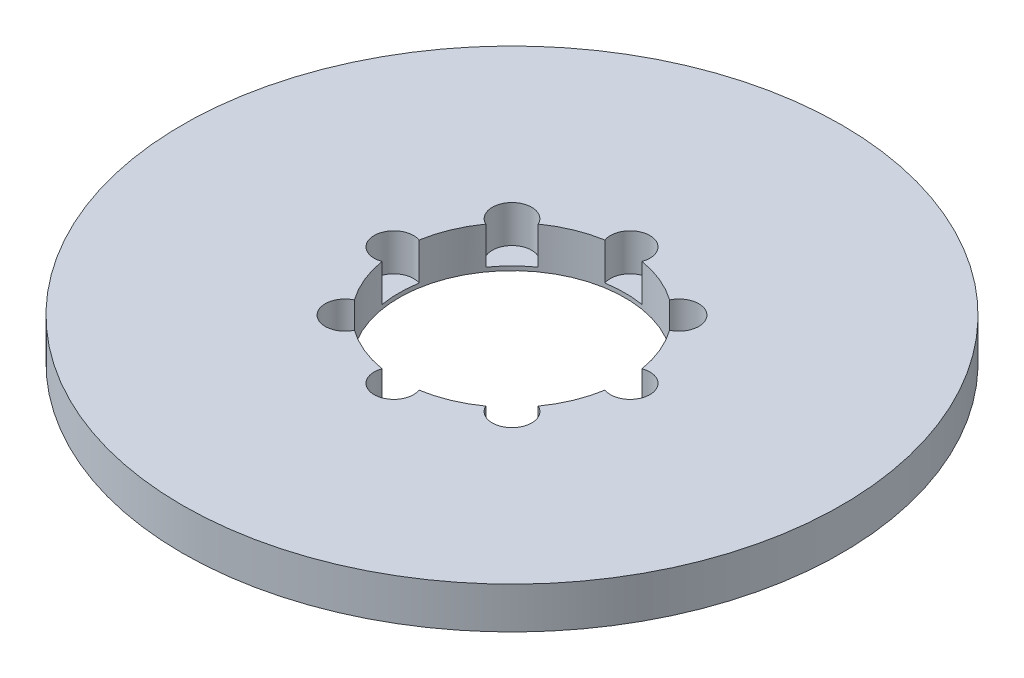
ISO-10303-21;
HEADER;
FILE_DESCRIPTION(('STEP AP214'),'2;1');
FILE_NAME('part.step','',(''),(''),'','','');
FILE_SCHEMA(('AUTOMOTIVE_DESIGN { 1 0 10303 214 1 1 1 1 }'));
ENDSEC;
DATA;
#1=APPLICATION_CONTEXT('core data for automotive mechanical design processes');
#2=APPLICATION_PROTOCOL_DEFINITION('international standard','automotive_design',2000,#1);
#3=PRODUCT_CONTEXT('',#1,'mechanical');
#4=PRODUCT('Part','Part','',(#3));
#5=PRODUCT_RELATED_PRODUCT_CATEGORY('part','',(#4));
#6=PRODUCT_DEFINITION_FORMATION('','',#4);
#7=PRODUCT_DEFINITION_CONTEXT('part definition',#1,'design');
#8=PRODUCT_DEFINITION('design','',#6,#7);
#9=PRODUCT_DEFINITION_SHAPE('','',#8);
#10=(LENGTH_UNIT() NAMED_UNIT(*) SI_UNIT(.MILLI.,.METRE.));
#11=(NAMED_UNIT(*) PLANE_ANGLE_UNIT() SI_UNIT($,.RADIAN.));
#12=(NAMED_UNIT(*) SI_UNIT($,.STERADIAN.) SOLID_ANGLE_UNIT());
#13=UNCERTAINTY_MEASURE_WITH_UNIT(LENGTH_MEASURE(1.E-05),#10,'distance_accuracy_value','');
#14=(GEOMETRIC_REPRESENTATION_CONTEXT(3) GLOBAL_UNCERTAINTY_ASSIGNED_CONTEXT((#13)) GLOBAL_UNIT_ASSIGNED_CONTEXT((#10,
#11,#12)) REPRESENTATION_CONTEXT('',''));
#15=CARTESIAN_POINT('',(0.,0.,0.));
#16=DIRECTION('',(0.,0.,1.));
#17=DIRECTION('',(1.,0.,0.));
#18=AXIS2_PLACEMENT_3D('',#15,#16,#17);
#19=CARTESIAN_POINT('',(0.,11.,0.));
#20=DIRECTION('',(0.,-1.,0.));
#21=DIRECTION('',(0.,0.,-1.));
#22=AXIS2_PLACEMENT_3D('',#19,#20,#21);
#23=CYLINDRICAL_SURFACE('',#22,87.5);
#24=CARTESIAN_POINT('',(0.,11.,0.));
#25=DIRECTION('',(0.,1.,0.));
#26=DIRECTION('',(0.,0.,1.));
#27=AXIS2_PLACEMENT_3D('',#24,#25,#26);
#28=CIRCLE('',#27,87.5);
#29=CARTESIAN_POINT('',(0.,11.,87.5));
#30=VERTEX_POINT('',#29);
#31=EDGE_CURVE('E195',#30,#30,#28,.T.);
#32=ORIENTED_EDGE('',*,*,#31,.F.);
#33=EDGE_LOOP('',(#32));
#34=FACE_BOUND('',#33,.T.);
#35=CARTESIAN_POINT('',(0.,0.,0.));
#36=DIRECTION('',(0.,1.,0.));
#37=DIRECTION('',(0.,0.,1.));
#38=AXIS2_PLACEMENT_3D('',#35,#36,#37);
#39=CIRCLE('',#38,87.5);
#40=CARTESIAN_POINT('',(0.,0.,87.5));
#41=VERTEX_POINT('',#40);
#42=EDGE_CURVE('E179',#41,#41,#39,.T.);
#43=ORIENTED_EDGE('',*,*,#42,.T.);
#44=EDGE_LOOP('',(#43));
#45=FACE_BOUND('',#44,.T.);
#46=ADVANCED_FACE('F39',(#34,#45),#23,.T.);
#47=CARTESIAN_POINT('',(0.,11.,0.));
#48=DIRECTION('',(0.,1.,0.));
#49=DIRECTION('',(0.,0.,1.));
#50=AXIS2_PLACEMENT_3D('',#47,#48,#49);
#51=PLANE('',#50);
#52=CARTESIAN_POINT('',(1.09510492240665E-13,11.,31.3650515677538));
#53=DIRECTION('',(0.,1.,0.));
#54=DIRECTION('',(1.,0.,0.));
#55=AXIS2_PLACEMENT_3D('',#52,#53,#54);
#56=CIRCLE('',#55,5.23700940678586);
#57=CARTESIAN_POINT('',(-4.92791098993009,11.,29.5924938671165));
#58=VERTEX_POINT('',#57);
#59=CARTESIAN_POINT('',(4.9279109899303,11.,29.5924938671164));
#60=VERTEX_POINT('',#59);
#61=EDGE_CURVE('E176',#58,#60,#56,.T.);
#62=ORIENTED_EDGE('',*,*,#61,.F.);
#63=CARTESIAN_POINT('',(0.,11.,0.));
#64=DIRECTION('',(0.,1.,0.));
#65=DIRECTION('',(0.,0.,1.));
#66=AXIS2_PLACEMENT_3D('',#63,#64,#65);
#67=CIRCLE('',#66,30.);
#68=CARTESIAN_POINT('',(-17.440493807596,11.,24.4096123637228));
#69=VERTEX_POINT('',#68);
#70=EDGE_CURVE('E166',#69,#58,#67,.T.);
#71=ORIENTED_EDGE('',*,*,#70,.F.);
#72=CARTESIAN_POINT('',(-22.1784406558244,11.,22.1784406558245));
#73=DIRECTION('',(0.,1.,0.));
#74=DIRECTION('',(0.707106781186549,0.,0.707106781186546));
#75=AXIS2_PLACEMENT_3D('',#72,#73,#74);
#76=CIRCLE('',#75,5.23700940678586);
#77=CARTESIAN_POINT('',(-24.4096123637227,11.,17.4404938075961));
#78=VERTEX_POINT('',#77);
#79=EDGE_CURVE('E147',#78,#69,#76,.T.);
#80=ORIENTED_EDGE('',*,*,#79,.F.);
#81=CARTESIAN_POINT('',(-29.5924938671165,11.,4.9279109899302));
#82=VERTEX_POINT('',#81);
#83=EDGE_CURVE('E180',#82,#78,#67,.T.);
#84=ORIENTED_EDGE('',*,*,#83,.F.);
#85=CARTESIAN_POINT('',(-31.3650515677538,11.,0.));
#86=DIRECTION('',(0.,1.,0.));
#87=DIRECTION('',(0.,0.,1.));
#88=AXIS2_PLACEMENT_3D('',#85,#86,#87);
#89=CIRCLE('',#88,5.23700940678586);
#90=CARTESIAN_POINT('',(-29.5924938671165,11.,-4.9279109899302));
#91=VERTEX_POINT('',#90);
#92=EDGE_CURVE('E186',#91,#82,#89,.T.);
#93=ORIENTED_EDGE('',*,*,#92,.F.);
#94=CARTESIAN_POINT('',(-24.4096123637229,11.,-17.4404938075957));
#95=VERTEX_POINT('',#94);
#96=EDGE_CURVE('E182',#95,#91,#67,.T.);
#97=ORIENTED_EDGE('',*,*,#96,.F.);
#98=CARTESIAN_POINT('',(-22.1784406558248,11.,-22.1784406558242));
#99=DIRECTION('',(0.,1.,0.));
#100=DIRECTION('',(-0.707106781186539,0.,0.707106781186556));
#101=AXIS2_PLACEMENT_3D('',#98,#99,#100);
#102=CIRCLE('',#101,5.23700940678586);
#103=CARTESIAN_POINT('',(-17.4404938075963,11.,-24.4096123637225));
#104=VERTEX_POINT('',#103);
#105=EDGE_CURVE('E446',#104,#95,#102,.T.);
#106=ORIENTED_EDGE('',*,*,#105,.F.);
#107=CARTESIAN_POINT('',(-4.92791098993051,11.,-29.5924938671164));
#108=VERTEX_POINT('',#107);
#109=EDGE_CURVE('E452',#108,#104,#67,.T.);
#110=ORIENTED_EDGE('',*,*,#109,.F.);
#111=CARTESIAN_POINT('',(-3.28531476721995E-13,11.,-31.3650515677538));
#112=DIRECTION('',(0.,1.,0.));
#113=DIRECTION('',(-1.,0.,0.));
#114=AXIS2_PLACEMENT_3D('',#111,#112,#113);
#115=CIRCLE('',#114,5.23700940678586);
#116=CARTESIAN_POINT('',(4.92791098992989,11.,-29.5924938671165));
#117=VERTEX_POINT('',#116);
#118=EDGE_CURVE('E477',#117,#108,#115,.T.);
#119=ORIENTED_EDGE('',*,*,#118,.F.);
#120=CARTESIAN_POINT('',(17.4404938075958,11.,-24.4096123637229));
#121=VERTEX_POINT('',#120);
#122=EDGE_CURVE('E460',#121,#117,#67,.T.);
#123=ORIENTED_EDGE('',*,*,#122,.F.);
#124=CARTESIAN_POINT('',(22.1784406558243,11.,-22.1784406558247));
#125=DIRECTION('',(0.,1.,0.));
#126=DIRECTION('',(-0.707106781186554,0.,-0.707106781186541));
#127=AXIS2_PLACEMENT_3D('',#124,#125,#126);
#128=CIRCLE('',#127,5.23700940678586);
#129=CARTESIAN_POINT('',(24.4096123637226,11.,-17.4404938075962));
#130=VERTEX_POINT('',#129);
#131=EDGE_CURVE('E464',#130,#121,#128,.T.);
#132=ORIENTED_EDGE('',*,*,#131,.F.);
#133=CARTESIAN_POINT('',(29.5924938671165,11.,-4.9279109899302));
#134=VERTEX_POINT('',#133);
#135=EDGE_CURVE('E459',#134,#130,#67,.T.);
#136=ORIENTED_EDGE('',*,*,#135,.F.);
#137=CARTESIAN_POINT('',(31.3650515677538,11.,0.));
#138=DIRECTION('',(0.,1.,0.));
#139=DIRECTION('',(0.,0.,-1.));
#140=AXIS2_PLACEMENT_3D('',#137,#138,#139);
#141=CIRCLE('',#140,5.23700940678586);
#142=CARTESIAN_POINT('',(29.5924938671165,11.,4.9279109899302));
#143=VERTEX_POINT('',#142);
#144=EDGE_CURVE('E469',#143,#134,#141,.T.);
#145=ORIENTED_EDGE('',*,*,#144,.F.);
#146=CARTESIAN_POINT('',(24.4096123637228,11.,17.4404938075959));
#147=VERTEX_POINT('',#146);
#148=EDGE_CURVE('E181',#147,#143,#67,.T.);
#149=ORIENTED_EDGE('',*,*,#148,.F.);
#150=CARTESIAN_POINT('',(22.1784406558246,11.,22.1784406558244));
#151=DIRECTION('',(0.,1.,0.));
#152=DIRECTION('',(0.707106781186544,0.,-0.707106781186551));
#153=AXIS2_PLACEMENT_3D('',#150,#151,#152);
#154=CIRCLE('',#153,5.23700940678586);
#155=CARTESIAN_POINT('',(17.4404938075961,11.,24.4096123637226));
#156=VERTEX_POINT('',#155);
#157=EDGE_CURVE('E475',#156,#147,#154,.T.);
#158=ORIENTED_EDGE('',*,*,#157,.F.);
#159=EDGE_CURVE('E177',#60,#156,#67,.T.);
#160=ORIENTED_EDGE('',*,*,#159,.F.);
#161=EDGE_LOOP('',(#62,#71,#80,#84,#93,#97,#106,#110,#119,#123,#132,#136,#145,#149,#158,#160));
#162=FACE_BOUND('',#161,.T.);
#163=ORIENTED_EDGE('',*,*,#31,.T.);
#164=EDGE_LOOP('',(#163));
#165=FACE_BOUND('',#164,.T.);
#166=ADVANCED_FACE('F172',(#162,#165),#51,.T.);
#167=CARTESIAN_POINT('',(0.,0.,0.));
#168=DIRECTION('',(0.,1.,0.));
#169=DIRECTION('',(0.,0.,1.));
#170=AXIS2_PLACEMENT_3D('',#167,#168,#169);
#171=PLANE('',#170);
#172=CARTESIAN_POINT('',(0.,0.,0.));
#173=DIRECTION('',(0.,1.,0.));
#174=DIRECTION('',(0.,0.,1.));
#175=AXIS2_PLACEMENT_3D('',#172,#173,#174);
#176=CIRCLE('',#175,30.);
#177=CARTESIAN_POINT('',(0.,0.,30.));
#178=VERTEX_POINT('',#177);
#179=EDGE_CURVE('E187',#178,#178,#176,.T.);
#180=ORIENTED_EDGE('',*,*,#179,.T.);
#181=EDGE_LOOP('',(#180));
#182=FACE_BOUND('',#181,.T.);
#183=ORIENTED_EDGE('',*,*,#42,.F.);
#184=EDGE_LOOP('',(#183));
#185=FACE_BOUND('',#184,.T.);
#186=ADVANCED_FACE('F270',(#182,#185),#171,.F.);
#187=CARTESIAN_POINT('',(0.,11.,0.));
#188=DIRECTION('',(0.,-1.,0.));
#189=DIRECTION('',(0.,0.,-1.));
#190=AXIS2_PLACEMENT_3D('',#187,#188,#189);
#191=CYLINDRICAL_SURFACE('',#190,30.);
#192=DIRECTION('',(0.,1.,0.));
#193=VECTOR('',#192,1.);
#194=CARTESIAN_POINT('',(-4.92791098993009,6.05336357226162,29.5924938671165));
#195=LINE('',#194,#193);
#196=CARTESIAN_POINT('',(-4.92791098993009,1.10672714452325,29.5924938671165));
#197=VERTEX_POINT('',#196);
#198=EDGE_CURVE('E11',#197,#58,#195,.T.);
#199=ORIENTED_EDGE('',*,*,#198,.F.);
#200=CARTESIAN_POINT('',(0.,1.10672714452325,0.));
#201=DIRECTION('',(0.,1.,0.));
#202=DIRECTION('',(0.,0.,1.));
#203=AXIS2_PLACEMENT_3D('',#200,#201,#202);
#204=CIRCLE('',#203,30.);
#205=CARTESIAN_POINT('',(4.9279109899303,1.10672714452325,29.5924938671164));
#206=VERTEX_POINT('',#205);
#207=EDGE_CURVE('E250',#197,#206,#204,.T.);
#208=ORIENTED_EDGE('',*,*,#207,.T.);
#209=DIRECTION('',(0.,1.,0.));
#210=VECTOR('',#209,1.);
#211=CARTESIAN_POINT('',(4.9279109899303,6.05336357226162,29.5924938671164));
#212=LINE('',#211,#210);
#213=EDGE_CURVE('E46',#60,#206,#212,.F.);
#214=ORIENTED_EDGE('',*,*,#213,.F.);
#215=ORIENTED_EDGE('',*,*,#159,.T.);
#216=DIRECTION('',(0.,1.,0.));
#217=VECTOR('',#216,1.);
#218=CARTESIAN_POINT('',(17.4404938075961,6.05336357226162,24.4096123637226));
#219=LINE('',#218,#217);
#220=CARTESIAN_POINT('',(17.4404938075961,1.10672714452325,24.4096123637226));
#221=VERTEX_POINT('',#220);
#222=EDGE_CURVE('E244',#221,#156,#219,.T.);
#223=ORIENTED_EDGE('',*,*,#222,.F.);
#224=CARTESIAN_POINT('',(0.,1.10672714452325,0.));
#225=DIRECTION('',(0.,1.,0.));
#226=DIRECTION('',(0.,0.,1.));
#227=AXIS2_PLACEMENT_3D('',#224,#225,#226);
#228=CIRCLE('',#227,30.);
#229=CARTESIAN_POINT('',(24.4096123637228,1.10672714452325,17.4404938075959));
#230=VERTEX_POINT('',#229);
#231=EDGE_CURVE('E238',#221,#230,#228,.T.);
#232=ORIENTED_EDGE('',*,*,#231,.T.);
#233=DIRECTION('',(0.,1.,0.));
#234=VECTOR('',#233,1.);
#235=CARTESIAN_POINT('',(24.4096123637228,6.05336357226162,17.4404938075959));
#236=LINE('',#235,#234);
#237=EDGE_CURVE('E242',#147,#230,#236,.F.);
#238=ORIENTED_EDGE('',*,*,#237,.F.);
#239=ORIENTED_EDGE('',*,*,#148,.T.);
#240=DIRECTION('',(0.,1.,0.));
#241=VECTOR('',#240,1.);
#242=CARTESIAN_POINT('',(29.5924938671165,6.05336357226162,4.9279109899302));
#243=LINE('',#242,#241);
#244=CARTESIAN_POINT('',(29.5924938671165,1.10672714452325,4.9279109899302));
#245=VERTEX_POINT('',#244);
#246=EDGE_CURVE('E236',#245,#143,#243,.T.);
#247=ORIENTED_EDGE('',*,*,#246,.F.);
#248=CARTESIAN_POINT('',(0.,1.10672714452325,0.));
#249=DIRECTION('',(0.,1.,0.));
#250=DIRECTION('',(0.,0.,1.));
#251=AXIS2_PLACEMENT_3D('',#248,#249,#250);
#252=CIRCLE('',#251,30.);
#253=CARTESIAN_POINT('',(29.5924938671165,1.10672714452325,-4.9279109899302));
#254=VERTEX_POINT('',#253);
#255=EDGE_CURVE('E235',#245,#254,#252,.T.);
#256=ORIENTED_EDGE('',*,*,#255,.T.);
#257=DIRECTION('',(0.,1.,0.));
#258=VECTOR('',#257,1.);
#259=CARTESIAN_POINT('',(29.5924938671165,6.05336357226162,-4.9279109899302));
#260=LINE('',#259,#258);
#261=EDGE_CURVE('E234',#134,#254,#260,.F.);
#262=ORIENTED_EDGE('',*,*,#261,.F.);
#263=ORIENTED_EDGE('',*,*,#135,.T.);
#264=DIRECTION('',(0.,1.,0.));
#265=VECTOR('',#264,1.);
#266=CARTESIAN_POINT('',(24.4096123637226,6.05336357226162,-17.4404938075962));
#267=LINE('',#266,#265);
#268=CARTESIAN_POINT('',(24.4096123637226,1.10672714452325,-17.4404938075962));
#269=VERTEX_POINT('',#268);
#270=EDGE_CURVE('E229',#269,#130,#267,.T.);
#271=ORIENTED_EDGE('',*,*,#270,.F.);
#272=CARTESIAN_POINT('',(0.,1.10672714452325,0.));
#273=DIRECTION('',(0.,1.,0.));
#274=DIRECTION('',(0.,0.,1.));
#275=AXIS2_PLACEMENT_3D('',#272,#273,#274);
#276=CIRCLE('',#275,30.);
#277=CARTESIAN_POINT('',(17.4404938075958,1.10672714452325,-24.4096123637229));
#278=VERTEX_POINT('',#277);
#279=EDGE_CURVE('E221',#269,#278,#276,.T.);
#280=ORIENTED_EDGE('',*,*,#279,.T.);
#281=DIRECTION('',(0.,1.,0.));
#282=VECTOR('',#281,1.);
#283=CARTESIAN_POINT('',(17.4404938075958,6.05336357226162,-24.4096123637229));
#284=LINE('',#283,#282);
#285=EDGE_CURVE('E230',#121,#278,#284,.F.);
#286=ORIENTED_EDGE('',*,*,#285,.F.);
#287=ORIENTED_EDGE('',*,*,#122,.T.);
#288=DIRECTION('',(0.,1.,0.));
#289=VECTOR('',#288,1.);
#290=CARTESIAN_POINT('',(4.92791098992989,6.05336357226162,-29.5924938671165));
#291=LINE('',#290,#289);
#292=CARTESIAN_POINT('',(4.92791098992989,1.10672714452325,-29.5924938671165));
#293=VERTEX_POINT('',#292);
#294=EDGE_CURVE('E225',#293,#117,#291,.T.);
#295=ORIENTED_EDGE('',*,*,#294,.F.);
#296=CARTESIAN_POINT('',(0.,1.10672714452325,0.));
#297=DIRECTION('',(0.,1.,0.));
#298=DIRECTION('',(0.,0.,1.));
#299=AXIS2_PLACEMENT_3D('',#296,#297,#298);
#300=CIRCLE('',#299,30.);
#301=CARTESIAN_POINT('',(-4.92791098993051,1.10672714452325,-29.5924938671164));
#302=VERTEX_POINT('',#301);
#303=EDGE_CURVE('E216',#293,#302,#300,.T.);
#304=ORIENTED_EDGE('',*,*,#303,.T.);
#305=DIRECTION('',(0.,1.,0.));
#306=VECTOR('',#305,1.);
#307=CARTESIAN_POINT('',(-4.92791098993051,6.05336357226162,-29.5924938671164));
#308=LINE('',#307,#306);
#309=EDGE_CURVE('E218',#108,#302,#308,.F.);
#310=ORIENTED_EDGE('',*,*,#309,.F.);
#311=ORIENTED_EDGE('',*,*,#109,.T.);
#312=DIRECTION('',(0.,1.,0.));
#313=VECTOR('',#312,1.);
#314=CARTESIAN_POINT('',(-17.4404938075963,6.05336357226162,-24.4096123637225));
#315=LINE('',#314,#313);
#316=CARTESIAN_POINT('',(-17.4404938075963,1.10672714452325,-24.4096123637225));
#317=VERTEX_POINT('',#316);
#318=EDGE_CURVE('E212',#317,#104,#315,.T.);
#319=ORIENTED_EDGE('',*,*,#318,.F.);
#320=CARTESIAN_POINT('',(0.,1.10672714452325,0.));
#321=DIRECTION('',(0.,1.,0.));
#322=DIRECTION('',(0.,0.,1.));
#323=AXIS2_PLACEMENT_3D('',#320,#321,#322);
#324=CIRCLE('',#323,30.);
#325=CARTESIAN_POINT('',(-24.4096123637229,1.10672714452325,-17.4404938075957));
#326=VERTEX_POINT('',#325);
#327=EDGE_CURVE('E208',#317,#326,#324,.T.);
#328=ORIENTED_EDGE('',*,*,#327,.T.);
#329=DIRECTION('',(0.,1.,0.));
#330=VECTOR('',#329,1.);
#331=CARTESIAN_POINT('',(-24.4096123637229,6.05336357226162,-17.4404938075957));
#332=LINE('',#331,#330);
#333=EDGE_CURVE('E211',#95,#326,#332,.F.);
#334=ORIENTED_EDGE('',*,*,#333,.F.);
#335=ORIENTED_EDGE('',*,*,#96,.T.);
#336=DIRECTION('',(0.,1.,0.));
#337=VECTOR('',#336,1.);
#338=CARTESIAN_POINT('',(-29.5924938671165,6.05336357226162,-4.9279109899302));
#339=LINE('',#338,#337);
#340=CARTESIAN_POINT('',(-29.5924938671165,1.10672714452325,-4.9279109899302));
#341=VERTEX_POINT('',#340);
#342=EDGE_CURVE('E201',#341,#91,#339,.T.);
#343=ORIENTED_EDGE('',*,*,#342,.F.);
#344=CARTESIAN_POINT('',(0.,1.10672714452325,0.));
#345=DIRECTION('',(0.,1.,0.));
#346=DIRECTION('',(0.,0.,1.));
#347=AXIS2_PLACEMENT_3D('',#344,#345,#346);
#348=CIRCLE('',#347,30.);
#349=CARTESIAN_POINT('',(-29.5924938671165,1.10672714452325,4.9279109899302));
#350=VERTEX_POINT('',#349);
#351=EDGE_CURVE('E194',#341,#350,#348,.T.);
#352=ORIENTED_EDGE('',*,*,#351,.T.);
#353=DIRECTION('',(0.,1.,0.));
#354=VECTOR('',#353,1.);
#355=CARTESIAN_POINT('',(-29.5924938671165,6.05336357226162,4.9279109899302));
#356=LINE('',#355,#354);
#357=EDGE_CURVE('E199',#82,#350,#356,.F.);
#358=ORIENTED_EDGE('',*,*,#357,.F.);
#359=ORIENTED_EDGE('',*,*,#83,.T.);
#360=DIRECTION('',(0.,1.,0.));
#361=VECTOR('',#360,1.);
#362=CARTESIAN_POINT('',(-24.4096123637227,6.05336357226162,17.4404938075961));
#363=LINE('',#362,#361);
#364=CARTESIAN_POINT('',(-24.4096123637227,1.10672714452325,17.4404938075961));
#365=VERTEX_POINT('',#364);
#366=EDGE_CURVE('E160',#365,#78,#363,.T.);
#367=ORIENTED_EDGE('',*,*,#366,.F.);
#368=CARTESIAN_POINT('',(0.,1.10672714452325,0.));
#369=DIRECTION('',(0.,1.,0.));
#370=DIRECTION('',(0.,0.,1.));
#371=AXIS2_PLACEMENT_3D('',#368,#369,#370);
#372=CIRCLE('',#371,30.);
#373=CARTESIAN_POINT('',(-17.440493807596,1.10672714452325,24.4096123637228));
#374=VERTEX_POINT('',#373);
#375=EDGE_CURVE('E168',#365,#374,#372,.T.);
#376=ORIENTED_EDGE('',*,*,#375,.T.);
#377=DIRECTION('',(0.,1.,0.));
#378=VECTOR('',#377,1.);
#379=CARTESIAN_POINT('',(-17.440493807596,6.05336357226162,24.4096123637227));
#380=LINE('',#379,#378);
#381=EDGE_CURVE('E152',#69,#374,#380,.F.);
#382=ORIENTED_EDGE('',*,*,#381,.F.);
#383=ORIENTED_EDGE('',*,*,#70,.T.);
#384=EDGE_LOOP('',(#199,#208,#214,#215,#223,#232,#238,#239,#247,#256,#262,#263,#271,#280,#286,
#287,#295,#304,#310,#311,#319,#328,#334,#335,#343,#352,#358,#359,#367,#376,#382,#383));
#385=FACE_BOUND('',#384,.T.);
#386=ORIENTED_EDGE('',*,*,#179,.F.);
#387=EDGE_LOOP('',(#386));
#388=FACE_BOUND('',#387,.T.);
#389=ADVANCED_FACE('F170',(#385,#388),#191,.F.);
#390=CARTESIAN_POINT('',(-31.3650515677538,1.10672714452325,0.));
#391=DIRECTION('',(0.,1.,0.));
#392=DIRECTION('',(0.,0.,1.));
#393=AXIS2_PLACEMENT_3D('',#390,#391,#392);
#394=CYLINDRICAL_SURFACE('',#393,5.23700940678586);
#395=ORIENTED_EDGE('',*,*,#342,.T.);
#396=ORIENTED_EDGE('',*,*,#92,.T.);
#397=ORIENTED_EDGE('',*,*,#357,.T.);
#398=CARTESIAN_POINT('',(-31.3650515677538,1.10672714452325,0.));
#399=DIRECTION('',(0.,1.,0.));
#400=DIRECTION('',(0.,0.,1.));
#401=AXIS2_PLACEMENT_3D('',#398,#399,#400);
#402=CIRCLE('',#401,5.23700940678586);
#403=EDGE_CURVE('E191',#341,#350,#402,.T.);
#404=ORIENTED_EDGE('',*,*,#403,.F.);
#405=EDGE_LOOP('',(#395,#396,#397,#404));
#406=FACE_BOUND('',#405,.T.);
#407=ADVANCED_FACE('F279',(#406),#394,.F.);
#408=CARTESIAN_POINT('',(-31.3650515677538,1.10672714452325,0.));
#409=DIRECTION('',(0.,1.,0.));
#410=DIRECTION('',(0.,0.,1.));
#411=AXIS2_PLACEMENT_3D('',#408,#409,#410);
#412=PLANE('',#411);
#413=ORIENTED_EDGE('',*,*,#403,.T.);
#414=ORIENTED_EDGE('',*,*,#351,.F.);
#415=EDGE_LOOP('',(#413,#414));
#416=FACE_BOUND('',#415,.T.);
#417=ADVANCED_FACE('F285',(#416),#412,.T.);
#418=CARTESIAN_POINT('',(-22.1784406558244,1.10672714452325,22.1784406558245));
#419=DIRECTION('',(0.,1.,0.));
#420=DIRECTION('',(0.,0.,1.));
#421=AXIS2_PLACEMENT_3D('',#418,#419,#420);
#422=CYLINDRICAL_SURFACE('',#421,5.23700940678586);
#423=ORIENTED_EDGE('',*,*,#366,.T.);
#424=ORIENTED_EDGE('',*,*,#79,.T.);
#425=ORIENTED_EDGE('',*,*,#381,.T.);
#426=CARTESIAN_POINT('',(-22.1784406558244,1.10672714452325,22.1784406558245));
#427=DIRECTION('',(0.,1.,0.));
#428=DIRECTION('',(0.707106781186549,0.,0.707106781186546));
#429=AXIS2_PLACEMENT_3D('',#426,#427,#428);
#430=CIRCLE('',#429,5.23700940678586);
#431=EDGE_CURVE('E165',#365,#374,#430,.T.);
#432=ORIENTED_EDGE('',*,*,#431,.F.);
#433=EDGE_LOOP('',(#423,#424,#425,#432));
#434=FACE_BOUND('',#433,.T.);
#435=ADVANCED_FACE('F155',(#434),#422,.F.);
#436=CARTESIAN_POINT('',(-22.1784406558244,1.10672714452325,22.1784406558245));
#437=DIRECTION('',(0.,1.,0.));
#438=DIRECTION('',(0.707106781186549,0.,0.707106781186546));
#439=AXIS2_PLACEMENT_3D('',#436,#437,#438);
#440=PLANE('',#439);
#441=ORIENTED_EDGE('',*,*,#431,.T.);
#442=ORIENTED_EDGE('',*,*,#375,.F.);
#443=EDGE_LOOP('',(#441,#442));
#444=FACE_BOUND('',#443,.T.);
#445=ADVANCED_FACE('F288',(#444),#440,.T.);
#446=CARTESIAN_POINT('',(-22.1784406558248,1.10672714452325,-22.1784406558242));
#447=DIRECTION('',(0.,1.,0.));
#448=DIRECTION('',(0.,0.,1.));
#449=AXIS2_PLACEMENT_3D('',#446,#447,#448);
#450=CYLINDRICAL_SURFACE('',#449,5.23700940678586);
#451=ORIENTED_EDGE('',*,*,#318,.T.);
#452=ORIENTED_EDGE('',*,*,#105,.T.);
#453=ORIENTED_EDGE('',*,*,#333,.T.);
#454=CARTESIAN_POINT('',(-22.1784406558248,1.10672714452325,-22.1784406558242));
#455=DIRECTION('',(0.,1.,0.));
#456=DIRECTION('',(-0.707106781186539,0.,0.707106781186556));
#457=AXIS2_PLACEMENT_3D('',#454,#455,#456);
#458=CIRCLE('',#457,5.23700940678586);
#459=EDGE_CURVE('E447',#317,#326,#458,.T.);
#460=ORIENTED_EDGE('',*,*,#459,.F.);
#461=EDGE_LOOP('',(#451,#452,#453,#460));
#462=FACE_BOUND('',#461,.T.);
#463=ADVANCED_FACE('F295',(#462),#450,.F.);
#464=CARTESIAN_POINT('',(-22.1784406558248,1.10672714452325,-22.1784406558242));
#465=DIRECTION('',(0.,1.,0.));
#466=DIRECTION('',(-0.707106781186539,0.,0.707106781186556));
#467=AXIS2_PLACEMENT_3D('',#464,#465,#466);
#468=PLANE('',#467);
#469=ORIENTED_EDGE('',*,*,#459,.T.);
#470=ORIENTED_EDGE('',*,*,#327,.F.);
#471=EDGE_LOOP('',(#469,#470));
#472=FACE_BOUND('',#471,.T.);
#473=ADVANCED_FACE('F375',(#472),#468,.T.);
#474=CARTESIAN_POINT('',(-3.28531476721995E-13,1.10672714452325,-31.3650515677538));
#475=DIRECTION('',(0.,1.,0.));
#476=DIRECTION('',(0.,0.,1.));
#477=AXIS2_PLACEMENT_3D('',#474,#475,#476);
#478=CYLINDRICAL_SURFACE('',#477,5.23700940678586);
#479=ORIENTED_EDGE('',*,*,#294,.T.);
#480=ORIENTED_EDGE('',*,*,#118,.T.);
#481=ORIENTED_EDGE('',*,*,#309,.T.);
#482=CARTESIAN_POINT('',(-3.28531476721995E-13,1.10672714452325,-31.3650515677538));
#483=DIRECTION('',(0.,1.,0.));
#484=DIRECTION('',(-1.,0.,0.));
#485=AXIS2_PLACEMENT_3D('',#482,#483,#484);
#486=CIRCLE('',#485,5.23700940678586);
#487=EDGE_CURVE('E467',#293,#302,#486,.T.);
#488=ORIENTED_EDGE('',*,*,#487,.F.);
#489=EDGE_LOOP('',(#479,#480,#481,#488));
#490=FACE_BOUND('',#489,.T.);
#491=ADVANCED_FACE('F361',(#490),#478,.F.);
#492=CARTESIAN_POINT('',(-3.28531476721995E-13,1.10672714452325,-31.3650515677538));
#493=DIRECTION('',(0.,1.,0.));
#494=DIRECTION('',(-1.,0.,0.));
#495=AXIS2_PLACEMENT_3D('',#492,#493,#494);
#496=PLANE('',#495);
#497=ORIENTED_EDGE('',*,*,#487,.T.);
#498=ORIENTED_EDGE('',*,*,#303,.F.);
#499=EDGE_LOOP('',(#497,#498));
#500=FACE_BOUND('',#499,.T.);
#501=ADVANCED_FACE('F297',(#500),#496,.T.);
#502=CARTESIAN_POINT('',(22.1784406558243,1.10672714452325,-22.1784406558247));
#503=DIRECTION('',(0.,1.,0.));
#504=DIRECTION('',(0.,0.,1.));
#505=AXIS2_PLACEMENT_3D('',#502,#503,#504);
#506=CYLINDRICAL_SURFACE('',#505,5.23700940678586);
#507=ORIENTED_EDGE('',*,*,#270,.T.);
#508=ORIENTED_EDGE('',*,*,#131,.T.);
#509=ORIENTED_EDGE('',*,*,#285,.T.);
#510=CARTESIAN_POINT('',(22.1784406558243,1.10672714452325,-22.1784406558247));
#511=DIRECTION('',(0.,1.,0.));
#512=DIRECTION('',(-0.707106781186554,0.,-0.707106781186541));
#513=AXIS2_PLACEMENT_3D('',#510,#511,#512);
#514=CIRCLE('',#513,5.23700940678586);
#515=EDGE_CURVE('E470',#269,#278,#514,.T.);
#516=ORIENTED_EDGE('',*,*,#515,.F.);
#517=EDGE_LOOP('',(#507,#508,#509,#516));
#518=FACE_BOUND('',#517,.T.);
#519=ADVANCED_FACE('F294',(#518),#506,.F.);
#520=CARTESIAN_POINT('',(22.1784406558243,1.10672714452325,-22.1784406558247));
#521=DIRECTION('',(0.,1.,0.));
#522=DIRECTION('',(-0.707106781186554,0.,-0.707106781186541));
#523=AXIS2_PLACEMENT_3D('',#520,#521,#522);
#524=PLANE('',#523);
#525=ORIENTED_EDGE('',*,*,#515,.T.);
#526=ORIENTED_EDGE('',*,*,#279,.F.);
#527=EDGE_LOOP('',(#525,#526));
#528=FACE_BOUND('',#527,.T.);
#529=ADVANCED_FACE('F300',(#528),#524,.T.);
#530=CARTESIAN_POINT('',(31.3650515677538,1.10672714452325,0.));
#531=DIRECTION('',(0.,1.,0.));
#532=DIRECTION('',(0.,0.,1.));
#533=AXIS2_PLACEMENT_3D('',#530,#531,#532);
#534=CYLINDRICAL_SURFACE('',#533,5.23700940678586);
#535=ORIENTED_EDGE('',*,*,#246,.T.);
#536=ORIENTED_EDGE('',*,*,#144,.T.);
#537=ORIENTED_EDGE('',*,*,#261,.T.);
#538=CARTESIAN_POINT('',(31.3650515677538,1.10672714452325,0.));
#539=DIRECTION('',(0.,1.,0.));
#540=DIRECTION('',(0.,0.,-1.));
#541=AXIS2_PLACEMENT_3D('',#538,#539,#540);
#542=CIRCLE('',#541,5.23700940678586);
#543=EDGE_CURVE('E472',#245,#254,#542,.T.);
#544=ORIENTED_EDGE('',*,*,#543,.F.);
#545=EDGE_LOOP('',(#535,#536,#537,#544));
#546=FACE_BOUND('',#545,.T.);
#547=ADVANCED_FACE('F305',(#546),#534,.F.);
#548=CARTESIAN_POINT('',(31.3650515677538,1.10672714452325,0.));
#549=DIRECTION('',(0.,1.,0.));
#550=DIRECTION('',(0.,0.,-1.));
#551=AXIS2_PLACEMENT_3D('',#548,#549,#550);
#552=PLANE('',#551);
#553=ORIENTED_EDGE('',*,*,#543,.T.);
#554=ORIENTED_EDGE('',*,*,#255,.F.);
#555=EDGE_LOOP('',(#553,#554));
#556=FACE_BOUND('',#555,.T.);
#557=ADVANCED_FACE('F308',(#556),#552,.T.);
#558=CARTESIAN_POINT('',(22.1784406558246,1.10672714452325,22.1784406558244));
#559=DIRECTION('',(0.,1.,0.));
#560=DIRECTION('',(0.,0.,1.));
#561=AXIS2_PLACEMENT_3D('',#558,#559,#560);
#562=CYLINDRICAL_SURFACE('',#561,5.23700940678586);
#563=ORIENTED_EDGE('',*,*,#222,.T.);
#564=ORIENTED_EDGE('',*,*,#157,.T.);
#565=ORIENTED_EDGE('',*,*,#237,.T.);
#566=CARTESIAN_POINT('',(22.1784406558246,1.10672714452325,22.1784406558244));
#567=DIRECTION('',(0.,1.,0.));
#568=DIRECTION('',(0.707106781186544,0.,-0.707106781186551));
#569=AXIS2_PLACEMENT_3D('',#566,#567,#568);
#570=CIRCLE('',#569,5.23700940678586);
#571=EDGE_CURVE('E56',#221,#230,#570,.T.);
#572=ORIENTED_EDGE('',*,*,#571,.F.);
#573=EDGE_LOOP('',(#563,#564,#565,#572));
#574=FACE_BOUND('',#573,.T.);
#575=ADVANCED_FACE('F309',(#574),#562,.F.);
#576=CARTESIAN_POINT('',(22.1784406558246,1.10672714452325,22.1784406558244));
#577=DIRECTION('',(0.,1.,0.));
#578=DIRECTION('',(0.707106781186544,0.,-0.707106781186551));
#579=AXIS2_PLACEMENT_3D('',#576,#577,#578);
#580=PLANE('',#579);
#581=ORIENTED_EDGE('',*,*,#571,.T.);
#582=ORIENTED_EDGE('',*,*,#231,.F.);
#583=EDGE_LOOP('',(#581,#582));
#584=FACE_BOUND('',#583,.T.);
#585=ADVANCED_FACE('F256',(#584),#580,.T.);
#586=CARTESIAN_POINT('',(1.09510492240665E-13,1.10672714452325,31.3650515677538));
#587=DIRECTION('',(0.,1.,0.));
#588=DIRECTION('',(0.,0.,1.));
#589=AXIS2_PLACEMENT_3D('',#586,#587,#588);
#590=CYLINDRICAL_SURFACE('',#589,5.23700940678586);
#591=ORIENTED_EDGE('',*,*,#198,.T.);
#592=ORIENTED_EDGE('',*,*,#61,.T.);
#593=ORIENTED_EDGE('',*,*,#213,.T.);
#594=CARTESIAN_POINT('',(1.09510492240665E-13,1.10672714452325,31.3650515677538));
#595=DIRECTION('',(0.,1.,0.));
#596=DIRECTION('',(1.,0.,0.));
#597=AXIS2_PLACEMENT_3D('',#594,#595,#596);
#598=CIRCLE('',#597,5.23700940678586);
#599=EDGE_CURVE('E55',#197,#206,#598,.T.);
#600=ORIENTED_EDGE('',*,*,#599,.F.);
#601=EDGE_LOOP('',(#591,#592,#593,#600));
#602=FACE_BOUND('',#601,.T.);
#603=ADVANCED_FACE('F253',(#602),#590,.F.);
#604=CARTESIAN_POINT('',(1.09510492240665E-13,1.10672714452325,31.3650515677538));
#605=DIRECTION('',(0.,1.,0.));
#606=DIRECTION('',(1.,0.,0.));
#607=AXIS2_PLACEMENT_3D('',#604,#605,#606);
#608=PLANE('',#607);
#609=ORIENTED_EDGE('',*,*,#599,.T.);
#610=ORIENTED_EDGE('',*,*,#207,.F.);
#611=EDGE_LOOP('',(#609,#610));
#612=FACE_BOUND('',#611,.T.);
#613=ADVANCED_FACE('F252',(#612),#608,.T.);
#614=CLOSED_SHELL('',(#46,#166,#186,#389,#407,#417,#435,#445,#463,#473,#491,#501,#519,#529,#547,
#557,#575,#585,#603,#613));
#615=MANIFOLD_SOLID_BREP('B2',#614);
#616=ADVANCED_BREP_SHAPE_REPRESENTATION('',(#18,#615),#14);
#617=SHAPE_DEFINITION_REPRESENTATION(#9,#616);
ENDSEC;
END-ISO-10303-21;
